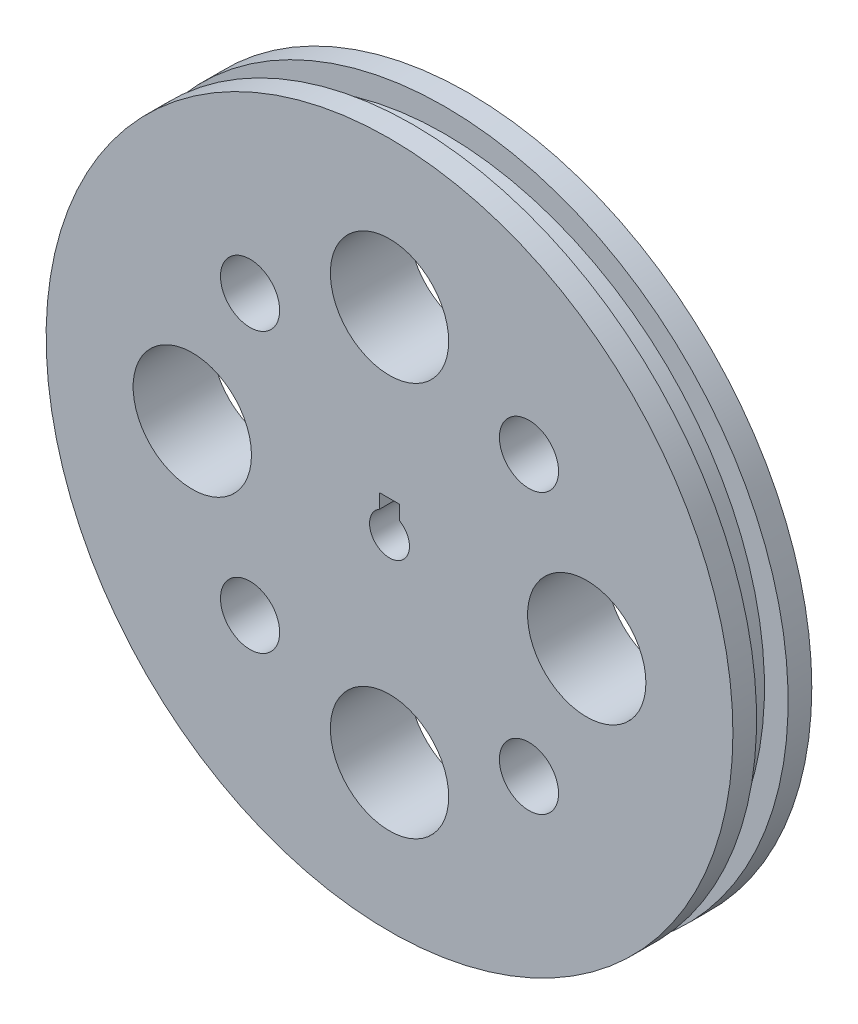
ISO-10303-21;
HEADER;
FILE_DESCRIPTION(('STEP AP214'),'2;1');
FILE_NAME('part.step','',(''),(''),'','','');
FILE_SCHEMA(('AUTOMOTIVE_DESIGN { 1 0 10303 214 1 1 1 1 }'));
ENDSEC;
DATA;
#1=APPLICATION_CONTEXT('core data for automotive mechanical design processes');
#2=APPLICATION_PROTOCOL_DEFINITION('international standard','automotive_design',2000,#1);
#3=PRODUCT_CONTEXT('',#1,'mechanical');
#4=PRODUCT('Part','Part','',(#3));
#5=PRODUCT_RELATED_PRODUCT_CATEGORY('part','',(#4));
#6=PRODUCT_DEFINITION_FORMATION('','',#4);
#7=PRODUCT_DEFINITION_CONTEXT('part definition',#1,'design');
#8=PRODUCT_DEFINITION('design','',#6,#7);
#9=PRODUCT_DEFINITION_SHAPE('','',#8);
#10=(LENGTH_UNIT() NAMED_UNIT(*) SI_UNIT(.MILLI.,.METRE.));
#11=(NAMED_UNIT(*) PLANE_ANGLE_UNIT() SI_UNIT($,.RADIAN.));
#12=(NAMED_UNIT(*) SI_UNIT($,.STERADIAN.) SOLID_ANGLE_UNIT());
#13=UNCERTAINTY_MEASURE_WITH_UNIT(LENGTH_MEASURE(1.E-05),#10,'distance_accuracy_value','');
#14=(GEOMETRIC_REPRESENTATION_CONTEXT(3) GLOBAL_UNCERTAINTY_ASSIGNED_CONTEXT((#13)) GLOBAL_UNIT_ASSIGNED_CONTEXT((#10,
#11,#12)) REPRESENTATION_CONTEXT('',''));
#15=CARTESIAN_POINT('',(0.,0.,0.));
#16=DIRECTION('',(0.,0.,1.));
#17=DIRECTION('',(1.,0.,0.));
#18=AXIS2_PLACEMENT_3D('',#15,#16,#17);
#19=CARTESIAN_POINT('',(0.,0.,25.4));
#20=DIRECTION('',(0.,0.,-1.));
#21=DIRECTION('',(-1.,0.,0.));
#22=AXIS2_PLACEMENT_3D('',#19,#20,#21);
#23=CYLINDRICAL_SURFACE('',#22,110.567781148838);
#24=CARTESIAN_POINT('',(0.,0.,17.7800000000001));
#25=DIRECTION('',(0.,0.,-1.));
#26=DIRECTION('',(0.,1.,0.));
#27=AXIS2_PLACEMENT_3D('',#24,#25,#26);
#28=CIRCLE('',#27,110.567781148838);
#29=CARTESIAN_POINT('',(0.,110.567781148838,17.78));
#30=VERTEX_POINT('',#29);
#31=EDGE_CURVE('E187',#30,#30,#28,.T.);
#32=ORIENTED_EDGE('',*,*,#31,.F.);
#33=EDGE_LOOP('',(#32));
#34=FACE_BOUND('',#33,.T.);
#35=CARTESIAN_POINT('',(0.,0.,25.4));
#36=DIRECTION('',(0.,0.,1.));
#37=DIRECTION('',(1.,0.,0.));
#38=AXIS2_PLACEMENT_3D('',#35,#36,#37);
#39=CIRCLE('',#38,110.567781148838);
#40=CARTESIAN_POINT('',(110.567781148838,0.,25.4));
#41=VERTEX_POINT('',#40);
#42=EDGE_CURVE('E134',#41,#41,#39,.T.);
#43=ORIENTED_EDGE('',*,*,#42,.F.);
#44=EDGE_LOOP('',(#43));
#45=FACE_BOUND('',#44,.T.);
#46=ADVANCED_FACE('F33',(#34,#45),#23,.T.);
#47=CARTESIAN_POINT('',(0.,0.,7.62000000000012));
#48=DIRECTION('',(0.,0.,-1.));
#49=DIRECTION('',(0.,1.,0.));
#50=AXIS2_PLACEMENT_3D('',#47,#48,#49);
#51=CIRCLE('',#50,110.567781148838);
#52=CARTESIAN_POINT('',(0.,110.567781148838,7.62));
#53=VERTEX_POINT('',#52);
#54=EDGE_CURVE('E351',#53,#53,#51,.T.);
#55=ORIENTED_EDGE('',*,*,#54,.T.);
#56=EDGE_LOOP('',(#55));
#57=FACE_BOUND('',#56,.T.);
#58=CARTESIAN_POINT('',(0.,0.,0.));
#59=DIRECTION('',(0.,0.,1.));
#60=DIRECTION('',(1.,0.,0.));
#61=AXIS2_PLACEMENT_3D('',#58,#59,#60);
#62=CIRCLE('',#61,110.567781148838);
#63=CARTESIAN_POINT('',(110.567781148838,0.,0.));
#64=VERTEX_POINT('',#63);
#65=EDGE_CURVE('E138',#64,#64,#62,.T.);
#66=ORIENTED_EDGE('',*,*,#65,.T.);
#67=EDGE_LOOP('',(#66));
#68=FACE_BOUND('',#67,.T.);
#69=ADVANCED_FACE('F35',(#57,#68),#23,.T.);
#70=CARTESIAN_POINT('',(0.,0.,25.4));
#71=DIRECTION('',(0.,0.,1.));
#72=DIRECTION('',(1.,0.,0.));
#73=AXIS2_PLACEMENT_3D('',#70,#71,#72);
#74=PLANE('',#73);
#75=DIRECTION('',(0.,-1.,0.));
#76=VECTOR('',#75,1.);
#77=CARTESIAN_POINT('',(-3.175,10.16,25.4));
#78=LINE('',#77,#76);
#79=CARTESIAN_POINT('',(-3.175,10.16,25.4));
#80=VERTEX_POINT('',#79);
#81=CARTESIAN_POINT('',(-3.175,5.588,25.4));
#82=VERTEX_POINT('',#81);
#83=EDGE_CURVE('E48',#80,#82,#78,.T.);
#84=ORIENTED_EDGE('',*,*,#83,.F.);
#85=DIRECTION('',(-1.,0.,0.));
#86=VECTOR('',#85,1.);
#87=CARTESIAN_POINT('',(-3.175,10.16,25.4));
#88=LINE('',#87,#86);
#89=CARTESIAN_POINT('',(3.175,10.16,25.4));
#90=VERTEX_POINT('',#89);
#91=EDGE_CURVE('E93',#90,#80,#88,.T.);
#92=ORIENTED_EDGE('',*,*,#91,.F.);
#93=DIRECTION('',(0.,1.,0.));
#94=VECTOR('',#93,1.);
#95=CARTESIAN_POINT('',(3.175,10.16,25.4));
#96=LINE('',#95,#94);
#97=CARTESIAN_POINT('',(3.175,5.588,25.4));
#98=VERTEX_POINT('',#97);
#99=EDGE_CURVE('E77',#98,#90,#96,.T.);
#100=ORIENTED_EDGE('',*,*,#99,.F.);
#101=CARTESIAN_POINT('',(0.,0.,25.4));
#102=DIRECTION('',(0.,0.,1.));
#103=DIRECTION('',(1.,0.,0.));
#104=AXIS2_PLACEMENT_3D('',#101,#102,#103);
#105=CIRCLE('',#104,6.42700311187104);
#106=EDGE_CURVE('E86',#82,#98,#105,.T.);
#107=ORIENTED_EDGE('',*,*,#106,.F.);
#108=EDGE_LOOP('',(#84,#92,#100,#107));
#109=FACE_BOUND('',#108,.T.);
#110=CARTESIAN_POINT('',(-44.9012806053459,44.9012806053457,25.4));
#111=DIRECTION('',(0.,0.,1.));
#112=DIRECTION('',(1.,0.,0.));
#113=AXIS2_PLACEMENT_3D('',#110,#111,#112);
#114=CIRCLE('',#113,9.52500000000033);
#115=CARTESIAN_POINT('',(-35.3762806053455,44.9012806053457,25.4));
#116=VERTEX_POINT('',#115);
#117=EDGE_CURVE('E100',#116,#116,#114,.T.);
#118=ORIENTED_EDGE('',*,*,#117,.F.);
#119=EDGE_LOOP('',(#118));
#120=FACE_BOUND('',#119,.T.);
#121=CARTESIAN_POINT('',(-63.5,0.,25.4));
#122=DIRECTION('',(0.,0.,1.));
#123=DIRECTION('',(1.,0.,0.));
#124=AXIS2_PLACEMENT_3D('',#121,#122,#123);
#125=CIRCLE('',#124,19.0500000000007);
#126=CARTESIAN_POINT('',(-44.4499999999993,0.,25.4));
#127=VERTEX_POINT('',#126);
#128=EDGE_CURVE('E106',#127,#127,#125,.T.);
#129=ORIENTED_EDGE('',*,*,#128,.F.);
#130=EDGE_LOOP('',(#129));
#131=FACE_BOUND('',#130,.T.);
#132=CARTESIAN_POINT('',(-44.9012806053457,-44.9012806053459,25.4));
#133=DIRECTION('',(0.,0.,1.));
#134=DIRECTION('',(1.,0.,0.));
#135=AXIS2_PLACEMENT_3D('',#132,#133,#134);
#136=CIRCLE('',#135,9.52500000000023);
#137=CARTESIAN_POINT('',(-35.3762806053454,-44.9012806053459,25.4));
#138=VERTEX_POINT('',#137);
#139=EDGE_CURVE('E110',#138,#138,#136,.T.);
#140=ORIENTED_EDGE('',*,*,#139,.F.);
#141=EDGE_LOOP('',(#140));
#142=FACE_BOUND('',#141,.T.);
#143=CARTESIAN_POINT('',(0.,-63.5,25.4));
#144=DIRECTION('',(0.,0.,1.));
#145=DIRECTION('',(1.,0.,0.));
#146=AXIS2_PLACEMENT_3D('',#143,#144,#145);
#147=CIRCLE('',#146,19.0500000000004);
#148=CARTESIAN_POINT('',(19.0500000000005,-63.5,25.4));
#149=VERTEX_POINT('',#148);
#150=EDGE_CURVE('E114',#149,#149,#147,.T.);
#151=ORIENTED_EDGE('',*,*,#150,.F.);
#152=EDGE_LOOP('',(#151));
#153=FACE_BOUND('',#152,.T.);
#154=CARTESIAN_POINT('',(44.9012806053459,-44.9012806053457,25.4));
#155=DIRECTION('',(0.,0.,1.));
#156=DIRECTION('',(1.,0.,0.));
#157=AXIS2_PLACEMENT_3D('',#154,#155,#156);
#158=CIRCLE('',#157,9.52500000000011);
#159=CARTESIAN_POINT('',(54.426280605346,-44.9012806053457,25.4));
#160=VERTEX_POINT('',#159);
#161=EDGE_CURVE('E118',#160,#160,#158,.T.);
#162=ORIENTED_EDGE('',*,*,#161,.F.);
#163=EDGE_LOOP('',(#162));
#164=FACE_BOUND('',#163,.T.);
#165=CARTESIAN_POINT('',(44.9012806053457,44.9012806053459,25.4));
#166=DIRECTION('',(0.,0.,1.));
#167=DIRECTION('',(1.,0.,0.));
#168=AXIS2_PLACEMENT_3D('',#165,#166,#167);
#169=CIRCLE('',#168,9.525);
#170=CARTESIAN_POINT('',(54.4262806053457,44.9012806053459,25.4));
#171=VERTEX_POINT('',#170);
#172=EDGE_CURVE('E122',#171,#171,#169,.T.);
#173=ORIENTED_EDGE('',*,*,#172,.F.);
#174=EDGE_LOOP('',(#173));
#175=FACE_BOUND('',#174,.T.);
#176=CARTESIAN_POINT('',(63.5,0.,25.4));
#177=DIRECTION('',(0.,0.,1.));
#178=DIRECTION('',(1.,0.,0.));
#179=AXIS2_PLACEMENT_3D('',#176,#177,#178);
#180=CIRCLE('',#179,19.0500000000002);
#181=CARTESIAN_POINT('',(82.5500000000002,0.,25.4));
#182=VERTEX_POINT('',#181);
#183=EDGE_CURVE('E126',#182,#182,#180,.T.);
#184=ORIENTED_EDGE('',*,*,#183,.F.);
#185=EDGE_LOOP('',(#184));
#186=FACE_BOUND('',#185,.T.);
#187=CARTESIAN_POINT('',(0.,63.5,25.4));
#188=DIRECTION('',(0.,0.,1.));
#189=DIRECTION('',(1.,0.,0.));
#190=AXIS2_PLACEMENT_3D('',#187,#188,#189);
#191=CIRCLE('',#190,19.05);
#192=CARTESIAN_POINT('',(19.05,63.5,25.4));
#193=VERTEX_POINT('',#192);
#194=EDGE_CURVE('E130',#193,#193,#191,.T.);
#195=ORIENTED_EDGE('',*,*,#194,.F.);
#196=EDGE_LOOP('',(#195));
#197=FACE_BOUND('',#196,.T.);
#198=ORIENTED_EDGE('',*,*,#42,.T.);
#199=EDGE_LOOP('',(#198));
#200=FACE_BOUND('',#199,.T.);
#201=ADVANCED_FACE('F90',(#109,#120,#131,#142,#153,#164,#175,#186,#197,#200),#74,.T.);
#202=CARTESIAN_POINT('',(0.,0.,0.));
#203=DIRECTION('',(0.,0.,1.));
#204=DIRECTION('',(1.,0.,0.));
#205=AXIS2_PLACEMENT_3D('',#202,#203,#204);
#206=PLANE('',#205);
#207=DIRECTION('',(-1.,0.,0.));
#208=VECTOR('',#207,1.);
#209=CARTESIAN_POINT('',(0.,10.16,0.));
#210=LINE('',#209,#208);
#211=CARTESIAN_POINT('',(3.175,10.16,0.));
#212=VERTEX_POINT('',#211);
#213=CARTESIAN_POINT('',(-3.175,10.16,0.));
#214=VERTEX_POINT('',#213);
#215=EDGE_CURVE('E41',#212,#214,#210,.T.);
#216=ORIENTED_EDGE('',*,*,#215,.T.);
#217=DIRECTION('',(0.,-1.,0.));
#218=VECTOR('',#217,1.);
#219=CARTESIAN_POINT('',(-3.175,0.,0.));
#220=LINE('',#219,#218);
#221=CARTESIAN_POINT('',(-3.175,5.588,0.));
#222=VERTEX_POINT('',#221);
#223=EDGE_CURVE('E11',#214,#222,#220,.T.);
#224=ORIENTED_EDGE('',*,*,#223,.T.);
#225=CARTESIAN_POINT('',(0.,0.,0.));
#226=DIRECTION('',(0.,0.,1.));
#227=DIRECTION('',(1.,0.,0.));
#228=AXIS2_PLACEMENT_3D('',#225,#226,#227);
#229=CIRCLE('',#228,6.42700311187104);
#230=CARTESIAN_POINT('',(3.175,5.588,0.));
#231=VERTEX_POINT('',#230);
#232=EDGE_CURVE('E137',#222,#231,#229,.T.);
#233=ORIENTED_EDGE('',*,*,#232,.T.);
#234=DIRECTION('',(0.,1.,0.));
#235=VECTOR('',#234,1.);
#236=CARTESIAN_POINT('',(3.175,0.,0.));
#237=LINE('',#236,#235);
#238=EDGE_CURVE('E80',#231,#212,#237,.T.);
#239=ORIENTED_EDGE('',*,*,#238,.T.);
#240=EDGE_LOOP('',(#216,#224,#233,#239));
#241=FACE_BOUND('',#240,.T.);
#242=CARTESIAN_POINT('',(-44.9012806053459,44.9012806053457,0.));
#243=DIRECTION('',(0.,0.,1.));
#244=DIRECTION('',(1.,0.,0.));
#245=AXIS2_PLACEMENT_3D('',#242,#243,#244);
#246=CIRCLE('',#245,9.52500000000033);
#247=CARTESIAN_POINT('',(-35.3762806053455,44.9012806053457,0.));
#248=VERTEX_POINT('',#247);
#249=EDGE_CURVE('E105',#248,#248,#246,.T.);
#250=ORIENTED_EDGE('',*,*,#249,.T.);
#251=EDGE_LOOP('',(#250));
#252=FACE_BOUND('',#251,.T.);
#253=CARTESIAN_POINT('',(-63.5,0.,0.));
#254=DIRECTION('',(0.,0.,1.));
#255=DIRECTION('',(1.,0.,0.));
#256=AXIS2_PLACEMENT_3D('',#253,#254,#255);
#257=CIRCLE('',#256,19.0500000000007);
#258=CARTESIAN_POINT('',(-44.4499999999993,0.,0.));
#259=VERTEX_POINT('',#258);
#260=EDGE_CURVE('E109',#259,#259,#257,.T.);
#261=ORIENTED_EDGE('',*,*,#260,.T.);
#262=EDGE_LOOP('',(#261));
#263=FACE_BOUND('',#262,.T.);
#264=CARTESIAN_POINT('',(-44.9012806053457,-44.9012806053459,0.));
#265=DIRECTION('',(0.,0.,1.));
#266=DIRECTION('',(1.,0.,0.));
#267=AXIS2_PLACEMENT_3D('',#264,#265,#266);
#268=CIRCLE('',#267,9.52500000000023);
#269=CARTESIAN_POINT('',(-35.3762806053454,-44.9012806053459,0.));
#270=VERTEX_POINT('',#269);
#271=EDGE_CURVE('E113',#270,#270,#268,.T.);
#272=ORIENTED_EDGE('',*,*,#271,.T.);
#273=EDGE_LOOP('',(#272));
#274=FACE_BOUND('',#273,.T.);
#275=CARTESIAN_POINT('',(0.,-63.5,0.));
#276=DIRECTION('',(0.,0.,1.));
#277=DIRECTION('',(1.,0.,0.));
#278=AXIS2_PLACEMENT_3D('',#275,#276,#277);
#279=CIRCLE('',#278,19.0500000000004);
#280=CARTESIAN_POINT('',(19.0500000000005,-63.5,0.));
#281=VERTEX_POINT('',#280);
#282=EDGE_CURVE('E117',#281,#281,#279,.T.);
#283=ORIENTED_EDGE('',*,*,#282,.T.);
#284=EDGE_LOOP('',(#283));
#285=FACE_BOUND('',#284,.T.);
#286=CARTESIAN_POINT('',(44.9012806053459,-44.9012806053457,0.));
#287=DIRECTION('',(0.,0.,1.));
#288=DIRECTION('',(1.,0.,0.));
#289=AXIS2_PLACEMENT_3D('',#286,#287,#288);
#290=CIRCLE('',#289,9.52500000000011);
#291=CARTESIAN_POINT('',(54.426280605346,-44.9012806053457,0.));
#292=VERTEX_POINT('',#291);
#293=EDGE_CURVE('E121',#292,#292,#290,.T.);
#294=ORIENTED_EDGE('',*,*,#293,.T.);
#295=EDGE_LOOP('',(#294));
#296=FACE_BOUND('',#295,.T.);
#297=CARTESIAN_POINT('',(44.9012806053457,44.9012806053459,0.));
#298=DIRECTION('',(0.,0.,1.));
#299=DIRECTION('',(1.,0.,0.));
#300=AXIS2_PLACEMENT_3D('',#297,#298,#299);
#301=CIRCLE('',#300,9.525);
#302=CARTESIAN_POINT('',(54.4262806053457,44.9012806053459,0.));
#303=VERTEX_POINT('',#302);
#304=EDGE_CURVE('E125',#303,#303,#301,.T.);
#305=ORIENTED_EDGE('',*,*,#304,.T.);
#306=EDGE_LOOP('',(#305));
#307=FACE_BOUND('',#306,.T.);
#308=CARTESIAN_POINT('',(63.5,0.,0.));
#309=DIRECTION('',(0.,0.,1.));
#310=DIRECTION('',(1.,0.,0.));
#311=AXIS2_PLACEMENT_3D('',#308,#309,#310);
#312=CIRCLE('',#311,19.0500000000002);
#313=CARTESIAN_POINT('',(82.5500000000002,0.,0.));
#314=VERTEX_POINT('',#313);
#315=EDGE_CURVE('E129',#314,#314,#312,.T.);
#316=ORIENTED_EDGE('',*,*,#315,.T.);
#317=EDGE_LOOP('',(#316));
#318=FACE_BOUND('',#317,.T.);
#319=CARTESIAN_POINT('',(0.,63.5,0.));
#320=DIRECTION('',(0.,0.,1.));
#321=DIRECTION('',(1.,0.,0.));
#322=AXIS2_PLACEMENT_3D('',#319,#320,#321);
#323=CIRCLE('',#322,19.05);
#324=CARTESIAN_POINT('',(19.05,63.5,0.));
#325=VERTEX_POINT('',#324);
#326=EDGE_CURVE('E133',#325,#325,#323,.T.);
#327=ORIENTED_EDGE('',*,*,#326,.T.);
#328=EDGE_LOOP('',(#327));
#329=FACE_BOUND('',#328,.T.);
#330=ORIENTED_EDGE('',*,*,#65,.F.);
#331=EDGE_LOOP('',(#330));
#332=FACE_BOUND('',#331,.T.);
#333=ADVANCED_FACE('F160',(#241,#252,#263,#274,#285,#296,#307,#318,#329,#332),#206,.F.);
#334=CARTESIAN_POINT('',(0.,63.5,-115.316));
#335=DIRECTION('',(0.,0.,1.));
#336=DIRECTION('',(1.,0.,0.));
#337=AXIS2_PLACEMENT_3D('',#334,#335,#336);
#338=CYLINDRICAL_SURFACE('',#337,19.05);
#339=ORIENTED_EDGE('',*,*,#194,.T.);
#340=EDGE_LOOP('',(#339));
#341=FACE_BOUND('',#340,.T.);
#342=ORIENTED_EDGE('',*,*,#326,.F.);
#343=EDGE_LOOP('',(#342));
#344=FACE_BOUND('',#343,.T.);
#345=ADVANCED_FACE('F195',(#341,#344),#338,.F.);
#346=CARTESIAN_POINT('',(63.5,0.,-115.316));
#347=DIRECTION('',(0.,0.,1.));
#348=DIRECTION('',(1.,0.,0.));
#349=AXIS2_PLACEMENT_3D('',#346,#347,#348);
#350=CYLINDRICAL_SURFACE('',#349,19.0500000000002);
#351=ORIENTED_EDGE('',*,*,#183,.T.);
#352=EDGE_LOOP('',(#351));
#353=FACE_BOUND('',#352,.T.);
#354=ORIENTED_EDGE('',*,*,#315,.F.);
#355=EDGE_LOOP('',(#354));
#356=FACE_BOUND('',#355,.T.);
#357=ADVANCED_FACE('F199',(#353,#356),#350,.F.);
#358=CARTESIAN_POINT('',(44.9012806053457,44.9012806053459,-115.316));
#359=DIRECTION('',(0.,0.,1.));
#360=DIRECTION('',(1.,0.,0.));
#361=AXIS2_PLACEMENT_3D('',#358,#359,#360);
#362=CYLINDRICAL_SURFACE('',#361,9.525);
#363=ORIENTED_EDGE('',*,*,#172,.T.);
#364=EDGE_LOOP('',(#363));
#365=FACE_BOUND('',#364,.T.);
#366=ORIENTED_EDGE('',*,*,#304,.F.);
#367=EDGE_LOOP('',(#366));
#368=FACE_BOUND('',#367,.T.);
#369=ADVANCED_FACE('F203',(#365,#368),#362,.F.);
#370=CARTESIAN_POINT('',(44.9012806053459,-44.9012806053457,-115.316));
#371=DIRECTION('',(0.,0.,1.));
#372=DIRECTION('',(1.,0.,0.));
#373=AXIS2_PLACEMENT_3D('',#370,#371,#372);
#374=CYLINDRICAL_SURFACE('',#373,9.52500000000011);
#375=ORIENTED_EDGE('',*,*,#161,.T.);
#376=EDGE_LOOP('',(#375));
#377=FACE_BOUND('',#376,.T.);
#378=ORIENTED_EDGE('',*,*,#293,.F.);
#379=EDGE_LOOP('',(#378));
#380=FACE_BOUND('',#379,.T.);
#381=ADVANCED_FACE('F207',(#377,#380),#374,.F.);
#382=CARTESIAN_POINT('',(0.,-63.5,-115.316));
#383=DIRECTION('',(0.,0.,1.));
#384=DIRECTION('',(1.,0.,0.));
#385=AXIS2_PLACEMENT_3D('',#382,#383,#384);
#386=CYLINDRICAL_SURFACE('',#385,19.0500000000004);
#387=ORIENTED_EDGE('',*,*,#150,.T.);
#388=EDGE_LOOP('',(#387));
#389=FACE_BOUND('',#388,.T.);
#390=ORIENTED_EDGE('',*,*,#282,.F.);
#391=EDGE_LOOP('',(#390));
#392=FACE_BOUND('',#391,.T.);
#393=ADVANCED_FACE('F211',(#389,#392),#386,.F.);
#394=CARTESIAN_POINT('',(-44.9012806053457,-44.9012806053459,-115.316));
#395=DIRECTION('',(0.,0.,1.));
#396=DIRECTION('',(1.,0.,0.));
#397=AXIS2_PLACEMENT_3D('',#394,#395,#396);
#398=CYLINDRICAL_SURFACE('',#397,9.52500000000023);
#399=ORIENTED_EDGE('',*,*,#139,.T.);
#400=EDGE_LOOP('',(#399));
#401=FACE_BOUND('',#400,.T.);
#402=ORIENTED_EDGE('',*,*,#271,.F.);
#403=EDGE_LOOP('',(#402));
#404=FACE_BOUND('',#403,.T.);
#405=ADVANCED_FACE('F215',(#401,#404),#398,.F.);
#406=CARTESIAN_POINT('',(-63.5,0.,-115.316));
#407=DIRECTION('',(0.,0.,1.));
#408=DIRECTION('',(1.,0.,0.));
#409=AXIS2_PLACEMENT_3D('',#406,#407,#408);
#410=CYLINDRICAL_SURFACE('',#409,19.0500000000007);
#411=ORIENTED_EDGE('',*,*,#128,.T.);
#412=EDGE_LOOP('',(#411));
#413=FACE_BOUND('',#412,.T.);
#414=ORIENTED_EDGE('',*,*,#260,.F.);
#415=EDGE_LOOP('',(#414));
#416=FACE_BOUND('',#415,.T.);
#417=ADVANCED_FACE('F174',(#413,#416),#410,.F.);
#418=CARTESIAN_POINT('',(-44.9012806053459,44.9012806053457,-115.316));
#419=DIRECTION('',(0.,0.,1.));
#420=DIRECTION('',(1.,0.,0.));
#421=AXIS2_PLACEMENT_3D('',#418,#419,#420);
#422=CYLINDRICAL_SURFACE('',#421,9.52500000000033);
#423=ORIENTED_EDGE('',*,*,#117,.T.);
#424=EDGE_LOOP('',(#423));
#425=FACE_BOUND('',#424,.T.);
#426=ORIENTED_EDGE('',*,*,#249,.F.);
#427=EDGE_LOOP('',(#426));
#428=FACE_BOUND('',#427,.T.);
#429=ADVANCED_FACE('F167',(#425,#428),#422,.F.);
#430=CARTESIAN_POINT('',(-3.175,10.16,-108.712));
#431=DIRECTION('',(-1.,0.,0.));
#432=DIRECTION('',(0.,-1.,0.));
#433=AXIS2_PLACEMENT_3D('',#430,#431,#432);
#434=PLANE('',#433);
#435=DIRECTION('',(0.,0.,1.));
#436=VECTOR('',#435,1.);
#437=CARTESIAN_POINT('',(-3.175,10.16,-108.712));
#438=LINE('',#437,#436);
#439=EDGE_CURVE('E98',#214,#80,#438,.T.);
#440=ORIENTED_EDGE('',*,*,#439,.T.);
#441=ORIENTED_EDGE('',*,*,#83,.T.);
#442=DIRECTION('',(0.,0.,1.));
#443=VECTOR('',#442,1.);
#444=CARTESIAN_POINT('',(-3.175,5.588,-108.712));
#445=LINE('',#444,#443);
#446=EDGE_CURVE('E83',#222,#82,#445,.T.);
#447=ORIENTED_EDGE('',*,*,#446,.F.);
#448=ORIENTED_EDGE('',*,*,#223,.F.);
#449=EDGE_LOOP('',(#440,#441,#447,#448));
#450=FACE_BOUND('',#449,.T.);
#451=ADVANCED_FACE('F165',(#450),#434,.F.);
#452=CARTESIAN_POINT('',(-3.175,10.16,-108.712));
#453=DIRECTION('',(0.,1.,0.));
#454=DIRECTION('',(0.,0.,1.));
#455=AXIS2_PLACEMENT_3D('',#452,#453,#454);
#456=PLANE('',#455);
#457=DIRECTION('',(0.,0.,1.));
#458=VECTOR('',#457,1.);
#459=CARTESIAN_POINT('',(3.175,10.16,-108.712));
#460=LINE('',#459,#458);
#461=EDGE_CURVE('E82',#212,#90,#460,.T.);
#462=ORIENTED_EDGE('',*,*,#461,.T.);
#463=ORIENTED_EDGE('',*,*,#91,.T.);
#464=ORIENTED_EDGE('',*,*,#439,.F.);
#465=ORIENTED_EDGE('',*,*,#215,.F.);
#466=EDGE_LOOP('',(#462,#463,#464,#465));
#467=FACE_BOUND('',#466,.T.);
#468=ADVANCED_FACE('F164',(#467),#456,.F.);
#469=CARTESIAN_POINT('',(3.175,10.16,-108.712));
#470=DIRECTION('',(1.,0.,0.));
#471=DIRECTION('',(0.,1.,0.));
#472=AXIS2_PLACEMENT_3D('',#469,#470,#471);
#473=PLANE('',#472);
#474=DIRECTION('',(0.,0.,1.));
#475=VECTOR('',#474,1.);
#476=CARTESIAN_POINT('',(3.175,5.588,-108.712));
#477=LINE('',#476,#475);
#478=EDGE_CURVE('E56',#231,#98,#477,.T.);
#479=ORIENTED_EDGE('',*,*,#478,.T.);
#480=ORIENTED_EDGE('',*,*,#99,.T.);
#481=ORIENTED_EDGE('',*,*,#461,.F.);
#482=ORIENTED_EDGE('',*,*,#238,.F.);
#483=EDGE_LOOP('',(#479,#480,#481,#482));
#484=FACE_BOUND('',#483,.T.);
#485=ADVANCED_FACE('F74',(#484),#473,.F.);
#486=CARTESIAN_POINT('',(0.,0.,-108.712));
#487=DIRECTION('',(0.,0.,1.));
#488=DIRECTION('',(1.,0.,0.));
#489=AXIS2_PLACEMENT_3D('',#486,#487,#488);
#490=CYLINDRICAL_SURFACE('',#489,6.42700311187104);
#491=ORIENTED_EDGE('',*,*,#446,.T.);
#492=ORIENTED_EDGE('',*,*,#106,.T.);
#493=ORIENTED_EDGE('',*,*,#478,.F.);
#494=ORIENTED_EDGE('',*,*,#232,.F.);
#495=EDGE_LOOP('',(#491,#492,#493,#494));
#496=FACE_BOUND('',#495,.T.);
#497=ADVANCED_FACE('F87',(#496),#490,.F.);
#498=CARTESIAN_POINT('',(0.,110.567781148838,17.78));
#499=DIRECTION('',(0.,0.,1.));
#500=DIRECTION('',(0.,-1.,0.));
#501=AXIS2_PLACEMENT_3D('',#498,#499,#500);
#502=PLANE('',#501);
#503=CARTESIAN_POINT('',(0.,0.,17.7800000000001));
#504=DIRECTION('',(0.,0.,-1.));
#505=DIRECTION('',(0.,1.,0.));
#506=AXIS2_PLACEMENT_3D('',#503,#504,#505);
#507=CIRCLE('',#506,102.947781148838);
#508=CARTESIAN_POINT('',(0.,102.947781148838,17.78));
#509=VERTEX_POINT('',#508);
#510=EDGE_CURVE('E355',#509,#509,#507,.T.);
#511=ORIENTED_EDGE('',*,*,#510,.F.);
#512=EDGE_LOOP('',(#511));
#513=FACE_BOUND('',#512,.T.);
#514=ORIENTED_EDGE('',*,*,#31,.T.);
#515=EDGE_LOOP('',(#514));
#516=FACE_BOUND('',#515,.T.);
#517=ADVANCED_FACE('F306',(#513,#516),#502,.F.);
#518=CARTESIAN_POINT('',(0.,0.,0.));
#519=DIRECTION('',(0.,0.,-1.));
#520=DIRECTION('',(0.,1.,0.));
#521=AXIS2_PLACEMENT_3D('',#518,#519,#520);
#522=CYLINDRICAL_SURFACE('',#521,102.947781148838);
#523=CARTESIAN_POINT('',(0.,0.,7.62000000000011));
#524=DIRECTION('',(0.,0.,-1.));
#525=DIRECTION('',(0.,1.,0.));
#526=AXIS2_PLACEMENT_3D('',#523,#524,#525);
#527=CIRCLE('',#526,102.947781148838);
#528=CARTESIAN_POINT('',(0.,102.947781148838,7.62));
#529=VERTEX_POINT('',#528);
#530=EDGE_CURVE('E354',#529,#529,#527,.T.);
#531=ORIENTED_EDGE('',*,*,#530,.F.);
#532=EDGE_LOOP('',(#531));
#533=FACE_BOUND('',#532,.T.);
#534=ORIENTED_EDGE('',*,*,#510,.T.);
#535=EDGE_LOOP('',(#534));
#536=FACE_BOUND('',#535,.T.);
#537=ADVANCED_FACE('F324',(#533,#536),#522,.T.);
#538=CARTESIAN_POINT('',(0.,110.567781148838,7.61999999999999));
#539=DIRECTION('',(0.,0.,-1.));
#540=DIRECTION('',(0.,1.,0.));
#541=AXIS2_PLACEMENT_3D('',#538,#539,#540);
#542=PLANE('',#541);
#543=ORIENTED_EDGE('',*,*,#54,.F.);
#544=EDGE_LOOP('',(#543));
#545=FACE_BOUND('',#544,.T.);
#546=ORIENTED_EDGE('',*,*,#530,.T.);
#547=EDGE_LOOP('',(#546));
#548=FACE_BOUND('',#547,.T.);
#549=ADVANCED_FACE('F334',(#545,#548),#542,.F.);
#550=CLOSED_SHELL('',(#46,#69,#201,#333,#345,#357,#369,#381,#393,#405,#417,#429,#451,#468,#485,
#497,#517,#537,#549));
#551=MANIFOLD_SOLID_BREP('B2',#550);
#552=ADVANCED_BREP_SHAPE_REPRESENTATION('',(#18,#551),#14);
#553=SHAPE_DEFINITION_REPRESENTATION(#9,#552);
ENDSEC;
END-ISO-10303-21;
